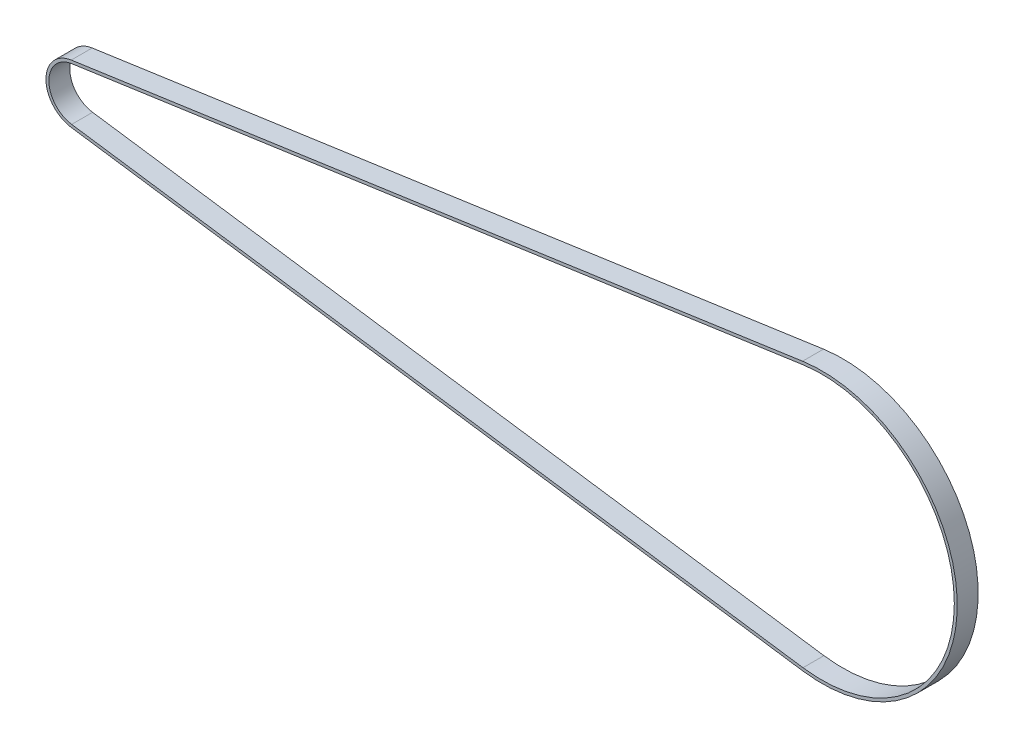
ISO-10303-21;
HEADER;
FILE_DESCRIPTION(('STEP AP214'),'2;1');
FILE_NAME('part.step','',(''),(''),'','','');
FILE_SCHEMA(('AUTOMOTIVE_DESIGN { 1 0 10303 214 1 1 1 1 }'));
ENDSEC;
DATA;
#1=APPLICATION_CONTEXT('core data for automotive mechanical design processes');
#2=APPLICATION_PROTOCOL_DEFINITION('international standard','automotive_design',2000,#1);
#3=PRODUCT_CONTEXT('',#1,'mechanical');
#4=PRODUCT('Part','Part','',(#3));
#5=PRODUCT_RELATED_PRODUCT_CATEGORY('part','',(#4));
#6=PRODUCT_DEFINITION_FORMATION('','',#4);
#7=PRODUCT_DEFINITION_CONTEXT('part definition',#1,'design');
#8=PRODUCT_DEFINITION('design','',#6,#7);
#9=PRODUCT_DEFINITION_SHAPE('','',#8);
#10=(LENGTH_UNIT() NAMED_UNIT(*) SI_UNIT(.MILLI.,.METRE.));
#11=(NAMED_UNIT(*) PLANE_ANGLE_UNIT() SI_UNIT($,.RADIAN.));
#12=(NAMED_UNIT(*) SI_UNIT($,.STERADIAN.) SOLID_ANGLE_UNIT());
#13=UNCERTAINTY_MEASURE_WITH_UNIT(LENGTH_MEASURE(1.E-05),#10,'distance_accuracy_value','');
#14=(GEOMETRIC_REPRESENTATION_CONTEXT(3) GLOBAL_UNCERTAINTY_ASSIGNED_CONTEXT((#13)) GLOBAL_UNIT_ASSIGNED_CONTEXT((#10,
#11,#12)) REPRESENTATION_CONTEXT('',''));
#15=CARTESIAN_POINT('',(0.,0.,0.));
#16=DIRECTION('',(0.,0.,1.));
#17=DIRECTION('',(1.,0.,0.));
#18=AXIS2_PLACEMENT_3D('',#15,#16,#17);
#19=CARTESIAN_POINT('',(-2.8616760588241,19.9568717772683,663.940858632139));
#20=DIRECTION('',(0.14194117647059,-0.989875094353901,0.));
#21=DIRECTION('',(0.989875094353901,0.14194117647059,0.));
#22=AXIS2_PLACEMENT_3D('',#19,#20,#21);
#23=PLANE('',#22);
#24=DIRECTION('',(-0.989875094353901,-0.14194117647059,0.));
#25=VECTOR('',#24,1.);
#26=CARTESIAN_POINT('',(-2.86167605882438,19.9568717772683,14.3001999999992));
#27=LINE('',#26,#25);
#28=CARTESIAN_POINT('',(496.86320217647,91.6139298575484,14.3001999999991));
#29=VERTEX_POINT('',#28);
#30=CARTESIAN_POINT('',(-2.8616760588241,19.9568717772683,14.3001999999992));
#31=VERTEX_POINT('',#30);
#32=EDGE_CURVE('E183',#29,#31,#27,.T.);
#33=ORIENTED_EDGE('',*,*,#32,.F.);
#34=DIRECTION('',(0.,0.,-1.));
#35=VECTOR('',#34,1.);
#36=CARTESIAN_POINT('',(496.86320217647,91.6139298575484,663.940858632139));
#37=LINE('',#36,#35);
#38=CARTESIAN_POINT('',(496.86320217647,91.6139298575484,0.));
#39=VERTEX_POINT('',#38);
#40=EDGE_CURVE('E74',#29,#39,#37,.T.);
#41=ORIENTED_EDGE('',*,*,#40,.T.);
#42=DIRECTION('',(-0.989875094353901,-0.14194117647059,0.));
#43=VECTOR('',#42,1.);
#44=CARTESIAN_POINT('',(-2.8616760588241,19.9568717772683,0.));
#45=LINE('',#44,#43);
#46=CARTESIAN_POINT('',(-2.8616760588241,19.9568717772683,0.));
#47=VERTEX_POINT('',#46);
#48=EDGE_CURVE('E157',#39,#47,#45,.T.);
#49=ORIENTED_EDGE('',*,*,#48,.T.);
#50=DIRECTION('',(0.,0.,-1.));
#51=VECTOR('',#50,1.);
#52=CARTESIAN_POINT('',(-2.8616760588241,19.9568717772683,663.940858632139));
#53=LINE('',#52,#51);
#54=EDGE_CURVE('E160',#31,#47,#53,.T.);
#55=ORIENTED_EDGE('',*,*,#54,.F.);
#56=EDGE_LOOP('',(#33,#41,#49,#55));
#57=FACE_BOUND('',#56,.T.);
#58=ADVANCED_FACE('F59',(#57),#23,.F.);
#59=CARTESIAN_POINT('',(510.,5.27355936696949E-13,663.940858632139));
#60=DIRECTION('',(0.,0.,-1.));
#61=DIRECTION('',(-1.,0.,0.));
#62=AXIS2_PLACEMENT_3D('',#59,#60,#61);
#63=CYLINDRICAL_SURFACE('',#62,92.551);
#64=CARTESIAN_POINT('',(510.,5.27355936696949E-13,14.300199999999));
#65=DIRECTION('',(0.,0.,1.));
#66=DIRECTION('',(0.,-1.,0.));
#67=AXIS2_PLACEMENT_3D('',#64,#65,#66);
#68=CIRCLE('',#67,92.551);
#69=CARTESIAN_POINT('',(496.863202176471,-91.6139298575474,14.300199999999));
#70=VERTEX_POINT('',#69);
#71=EDGE_CURVE('E186',#70,#29,#68,.T.);
#72=ORIENTED_EDGE('',*,*,#71,.F.);
#73=DIRECTION('',(0.,0.,-1.));
#74=VECTOR('',#73,1.);
#75=CARTESIAN_POINT('',(496.863202176471,-91.6139298575474,663.940858632139));
#76=LINE('',#75,#74);
#77=CARTESIAN_POINT('',(496.863202176471,-91.6139298575474,0.));
#78=VERTEX_POINT('',#77);
#79=EDGE_CURVE('E163',#70,#78,#76,.T.);
#80=ORIENTED_EDGE('',*,*,#79,.T.);
#81=CARTESIAN_POINT('',(510.,5.27355936696949E-13,0.));
#82=DIRECTION('',(0.,0.,-1.));
#83=DIRECTION('',(-1.,0.,0.));
#84=AXIS2_PLACEMENT_3D('',#81,#82,#83);
#85=CIRCLE('',#84,92.551);
#86=EDGE_CURVE('E155',#78,#39,#85,.F.);
#87=ORIENTED_EDGE('',*,*,#86,.T.);
#88=ORIENTED_EDGE('',*,*,#40,.F.);
#89=EDGE_LOOP('',(#72,#80,#87,#88));
#90=FACE_BOUND('',#89,.T.);
#91=ADVANCED_FACE('F185',(#90),#63,.T.);
#92=CARTESIAN_POINT('',(-2.86167605882401,-19.9568717772697,663.940858632139));
#93=DIRECTION('',(0.141941176470586,0.989875094353902,0.));
#94=DIRECTION('',(-0.989875094353902,0.141941176470586,0.));
#95=AXIS2_PLACEMENT_3D('',#92,#93,#94);
#96=PLANE('',#95);
#97=DIRECTION('',(0.989875094353902,-0.141941176470586,0.));
#98=VECTOR('',#97,1.);
#99=CARTESIAN_POINT('',(-2.86167605882419,-19.9568717772697,14.3001999999992));
#100=LINE('',#99,#98);
#101=CARTESIAN_POINT('',(-2.8616760588242,-19.9568717772697,14.3001999999991));
#102=VERTEX_POINT('',#101);
#103=EDGE_CURVE('E171',#102,#70,#100,.T.);
#104=ORIENTED_EDGE('',*,*,#103,.F.);
#105=DIRECTION('',(0.,0.,-1.));
#106=VECTOR('',#105,1.);
#107=CARTESIAN_POINT('',(-2.8616760588242,-19.9568717772697,663.940858632139));
#108=LINE('',#107,#106);
#109=CARTESIAN_POINT('',(-2.8616760588242,-19.9568717772697,0.));
#110=VERTEX_POINT('',#109);
#111=EDGE_CURVE('E67',#102,#110,#108,.T.);
#112=ORIENTED_EDGE('',*,*,#111,.T.);
#113=DIRECTION('',(0.989875094353902,-0.141941176470586,0.));
#114=VECTOR('',#113,1.);
#115=CARTESIAN_POINT('',(-2.86167605882401,-19.9568717772697,0.));
#116=LINE('',#115,#114);
#117=EDGE_CURVE('E152',#110,#78,#116,.T.);
#118=ORIENTED_EDGE('',*,*,#117,.T.);
#119=ORIENTED_EDGE('',*,*,#79,.F.);
#120=EDGE_LOOP('',(#104,#112,#118,#119));
#121=FACE_BOUND('',#120,.T.);
#122=ADVANCED_FACE('F167',(#121),#96,.F.);
#123=CARTESIAN_POINT('',(-5.27355936696949E-13,-6.66133814775094E-13,663.940858632139));
#124=DIRECTION('',(0.,0.,-1.));
#125=DIRECTION('',(-1.,0.,0.));
#126=AXIS2_PLACEMENT_3D('',#123,#124,#125);
#127=CYLINDRICAL_SURFACE('',#126,20.161);
#128=CARTESIAN_POINT('',(-5.27355936696949E-13,-6.66133814775094E-13,14.3001999999992));
#129=DIRECTION('',(0.,0.,1.));
#130=DIRECTION('',(0.,-1.,0.));
#131=AXIS2_PLACEMENT_3D('',#128,#129,#130);
#132=CIRCLE('',#131,20.161);
#133=EDGE_CURVE('E180',#31,#102,#132,.T.);
#134=ORIENTED_EDGE('',*,*,#133,.F.);
#135=ORIENTED_EDGE('',*,*,#54,.T.);
#136=CARTESIAN_POINT('',(-5.27355936696949E-13,-6.66133814775094E-13,0.));
#137=DIRECTION('',(0.,0.,-1.));
#138=DIRECTION('',(-1.,0.,0.));
#139=AXIS2_PLACEMENT_3D('',#136,#137,#138);
#140=CIRCLE('',#139,20.161);
#141=EDGE_CURVE('E149',#47,#110,#140,.F.);
#142=ORIENTED_EDGE('',*,*,#141,.T.);
#143=ORIENTED_EDGE('',*,*,#111,.F.);
#144=EDGE_LOOP('',(#134,#135,#142,#143));
#145=FACE_BOUND('',#144,.T.);
#146=ADVANCED_FACE('F61',(#145),#127,.T.);
#147=CARTESIAN_POINT('',(-5.27355936696949E-13,-6.66133814775094E-13,0.));
#148=DIRECTION('',(0.,0.,-1.));
#149=DIRECTION('',(-1.,0.,0.));
#150=AXIS2_PLACEMENT_3D('',#147,#148,#149);
#151=PLANE('',#150);
#152=ORIENTED_EDGE('',*,*,#141,.F.);
#153=ORIENTED_EDGE('',*,*,#48,.F.);
#154=ORIENTED_EDGE('',*,*,#86,.F.);
#155=ORIENTED_EDGE('',*,*,#117,.F.);
#156=EDGE_LOOP('',(#152,#153,#154,#155));
#157=FACE_BOUND('',#156,.T.);
#158=DIRECTION('',(-0.989875094353901,-0.14194117647059,0.));
#159=VECTOR('',#158,1.);
#160=CARTESIAN_POINT('',(-2.57779370588292,17.9771215885605,0.));
#161=LINE('',#160,#159);
#162=CARTESIAN_POINT('',(497.147084529411,89.6341796688406,0.));
#163=VERTEX_POINT('',#162);
#164=CARTESIAN_POINT('',(-2.57779370588292,17.9771215885605,0.));
#165=VERTEX_POINT('',#164);
#166=EDGE_CURVE('E139',#163,#165,#161,.T.);
#167=ORIENTED_EDGE('',*,*,#166,.T.);
#168=CARTESIAN_POINT('',(-5.27355936696949E-13,-6.66133814775094E-13,0.));
#169=DIRECTION('',(0.,0.,1.));
#170=DIRECTION('',(-1.,0.,0.));
#171=AXIS2_PLACEMENT_3D('',#168,#169,#170);
#172=CIRCLE('',#171,18.161);
#173=CARTESIAN_POINT('',(-2.57779370588284,-17.9771215885619,0.));
#174=VERTEX_POINT('',#173);
#175=EDGE_CURVE('E188',#165,#174,#172,.T.);
#176=ORIENTED_EDGE('',*,*,#175,.T.);
#177=DIRECTION('',(0.989875094353902,-0.141941176470586,0.));
#178=VECTOR('',#177,1.);
#179=CARTESIAN_POINT('',(497.147084529412,-89.6341796688396,0.));
#180=LINE('',#179,#178);
#181=CARTESIAN_POINT('',(497.147084529412,-89.6341796688396,0.));
#182=VERTEX_POINT('',#181);
#183=EDGE_CURVE('E195',#174,#182,#180,.T.);
#184=ORIENTED_EDGE('',*,*,#183,.T.);
#185=CARTESIAN_POINT('',(510.,5.27355936696949E-13,0.));
#186=DIRECTION('',(0.,0.,1.));
#187=DIRECTION('',(-1.,0.,0.));
#188=AXIS2_PLACEMENT_3D('',#185,#186,#187);
#189=CIRCLE('',#188,90.551);
#190=EDGE_CURVE('E198',#182,#163,#189,.T.);
#191=ORIENTED_EDGE('',*,*,#190,.T.);
#192=EDGE_LOOP('',(#167,#176,#184,#191));
#193=FACE_BOUND('',#192,.T.);
#194=ADVANCED_FACE('F177',(#157,#193),#151,.T.);
#195=CARTESIAN_POINT('',(-2.57779370588292,17.9771215885605,663.940858632139));
#196=DIRECTION('',(0.14194117647059,-0.989875094353901,0.));
#197=DIRECTION('',(0.989875094353901,0.14194117647059,0.));
#198=AXIS2_PLACEMENT_3D('',#195,#196,#197);
#199=PLANE('',#198);
#200=DIRECTION('',(0.,0.,-1.));
#201=VECTOR('',#200,1.);
#202=CARTESIAN_POINT('',(497.147084529411,89.6341796688406,663.940858632139));
#203=LINE('',#202,#201);
#204=CARTESIAN_POINT('',(497.147084529411,89.6341796688406,14.300199999999));
#205=VERTEX_POINT('',#204);
#206=EDGE_CURVE('E131',#205,#163,#203,.T.);
#207=ORIENTED_EDGE('',*,*,#206,.F.);
#208=DIRECTION('',(-0.989875094353901,-0.14194117647059,0.));
#209=VECTOR('',#208,1.);
#210=CARTESIAN_POINT('',(-2.5777937058832,17.9771215885605,14.3001999999992));
#211=LINE('',#210,#209);
#212=CARTESIAN_POINT('',(-2.57779370588292,17.9771215885605,14.3001999999991));
#213=VERTEX_POINT('',#212);
#214=EDGE_CURVE('E12',#205,#213,#211,.T.);
#215=ORIENTED_EDGE('',*,*,#214,.T.);
#216=DIRECTION('',(0.,0.,-1.));
#217=VECTOR('',#216,1.);
#218=CARTESIAN_POINT('',(-2.57779370588292,17.9771215885605,663.940858632139));
#219=LINE('',#218,#217);
#220=EDGE_CURVE('E141',#213,#165,#219,.T.);
#221=ORIENTED_EDGE('',*,*,#220,.T.);
#222=ORIENTED_EDGE('',*,*,#166,.F.);
#223=EDGE_LOOP('',(#207,#215,#221,#222));
#224=FACE_BOUND('',#223,.T.);
#225=ADVANCED_FACE('F137',(#224),#199,.T.);
#226=CARTESIAN_POINT('',(510.,5.27355936696949E-13,663.940858632139));
#227=DIRECTION('',(0.,0.,-1.));
#228=DIRECTION('',(-1.,0.,0.));
#229=AXIS2_PLACEMENT_3D('',#226,#227,#228);
#230=CYLINDRICAL_SURFACE('',#229,90.551);
#231=DIRECTION('',(0.,0.,-1.));
#232=VECTOR('',#231,1.);
#233=CARTESIAN_POINT('',(497.147084529412,-89.6341796688396,663.940858632139));
#234=LINE('',#233,#232);
#235=CARTESIAN_POINT('',(497.147084529412,-89.6341796688396,14.300199999999));
#236=VERTEX_POINT('',#235);
#237=EDGE_CURVE('E133',#236,#182,#234,.T.);
#238=ORIENTED_EDGE('',*,*,#237,.F.);
#239=CARTESIAN_POINT('',(510.,5.27355936696949E-13,14.300199999999));
#240=DIRECTION('',(0.,0.,1.));
#241=DIRECTION('',(0.,-1.,0.));
#242=AXIS2_PLACEMENT_3D('',#239,#240,#241);
#243=CIRCLE('',#242,90.551);
#244=EDGE_CURVE('E124',#236,#205,#243,.T.);
#245=ORIENTED_EDGE('',*,*,#244,.T.);
#246=ORIENTED_EDGE('',*,*,#206,.T.);
#247=ORIENTED_EDGE('',*,*,#190,.F.);
#248=EDGE_LOOP('',(#238,#245,#246,#247));
#249=FACE_BOUND('',#248,.T.);
#250=ADVANCED_FACE('F129',(#249),#230,.F.);
#251=CARTESIAN_POINT('',(497.147084529412,-89.6341796688396,663.940858632139));
#252=DIRECTION('',(0.141941176470586,0.989875094353902,0.));
#253=DIRECTION('',(-0.989875094353902,0.141941176470586,0.));
#254=AXIS2_PLACEMENT_3D('',#251,#252,#253);
#255=PLANE('',#254);
#256=DIRECTION('',(0.,0.,-1.));
#257=VECTOR('',#256,1.);
#258=CARTESIAN_POINT('',(-2.57779370588284,-17.9771215885619,663.940858632139));
#259=LINE('',#258,#257);
#260=CARTESIAN_POINT('',(-2.57779370588279,-17.9771215885619,14.3001999999992));
#261=VERTEX_POINT('',#260);
#262=EDGE_CURVE('E143',#261,#174,#259,.T.);
#263=ORIENTED_EDGE('',*,*,#262,.F.);
#264=DIRECTION('',(0.989875094353902,-0.141941176470586,0.));
#265=VECTOR('',#264,1.);
#266=CARTESIAN_POINT('',(497.147084529412,-89.6341796688396,14.3001999999991));
#267=LINE('',#266,#265);
#268=EDGE_CURVE('E135',#261,#236,#267,.T.);
#269=ORIENTED_EDGE('',*,*,#268,.T.);
#270=ORIENTED_EDGE('',*,*,#237,.T.);
#271=ORIENTED_EDGE('',*,*,#183,.F.);
#272=EDGE_LOOP('',(#263,#269,#270,#271));
#273=FACE_BOUND('',#272,.T.);
#274=ADVANCED_FACE('F203',(#273),#255,.T.);
#275=CARTESIAN_POINT('',(-5.27355936696949E-13,-6.66133814775094E-13,663.940858632139));
#276=DIRECTION('',(0.,0.,-1.));
#277=DIRECTION('',(-1.,0.,0.));
#278=AXIS2_PLACEMENT_3D('',#275,#276,#277);
#279=CYLINDRICAL_SURFACE('',#278,18.161);
#280=ORIENTED_EDGE('',*,*,#220,.F.);
#281=CARTESIAN_POINT('',(-5.27355936696949E-13,-6.66133814775094E-13,14.3001999999992));
#282=DIRECTION('',(0.,0.,1.));
#283=DIRECTION('',(0.,-1.,0.));
#284=AXIS2_PLACEMENT_3D('',#281,#282,#283);
#285=CIRCLE('',#284,18.161);
#286=EDGE_CURVE('E82',#213,#261,#285,.T.);
#287=ORIENTED_EDGE('',*,*,#286,.T.);
#288=ORIENTED_EDGE('',*,*,#262,.T.);
#289=ORIENTED_EDGE('',*,*,#175,.F.);
#290=EDGE_LOOP('',(#280,#287,#288,#289));
#291=FACE_BOUND('',#290,.T.);
#292=ADVANCED_FACE('F207',(#291),#279,.F.);
#293=CARTESIAN_POINT('',(0.10258278832027,19.3748147299056,14.3001999999992));
#294=DIRECTION('',(0.,0.,1.));
#295=DIRECTION('',(-0.999985983655734,0.00529457194445237,0.));
#296=AXIS2_PLACEMENT_3D('',#293,#294,#295);
#297=PLANE('',#296);
#298=ORIENTED_EDGE('',*,*,#286,.F.);
#299=ORIENTED_EDGE('',*,*,#214,.F.);
#300=ORIENTED_EDGE('',*,*,#244,.F.);
#301=ORIENTED_EDGE('',*,*,#268,.F.);
#302=EDGE_LOOP('',(#298,#299,#300,#301));
#303=FACE_BOUND('',#302,.T.);
#304=ORIENTED_EDGE('',*,*,#32,.T.);
#305=ORIENTED_EDGE('',*,*,#133,.T.);
#306=ORIENTED_EDGE('',*,*,#103,.T.);
#307=ORIENTED_EDGE('',*,*,#71,.T.);
#308=EDGE_LOOP('',(#304,#305,#306,#307));
#309=FACE_BOUND('',#308,.T.);
#310=ADVANCED_FACE('F122',(#303,#309),#297,.T.);
#311=CLOSED_SHELL('',(#58,#91,#122,#146,#194,#225,#250,#274,#292,#310));
#312=MANIFOLD_SOLID_BREP('B2',#311);
#313=ADVANCED_BREP_SHAPE_REPRESENTATION('',(#18,#312),#14);
#314=SHAPE_DEFINITION_REPRESENTATION(#9,#313);
ENDSEC;
END-ISO-10303-21;
